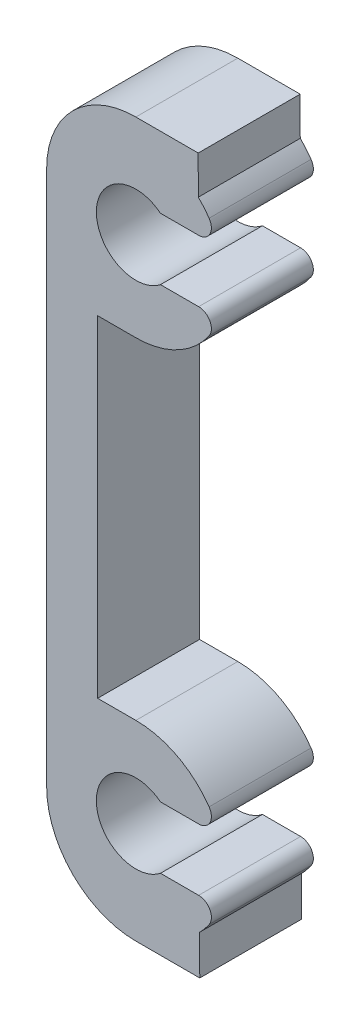
ISO-10303-21;
HEADER;
FILE_DESCRIPTION(('STEP AP214'),'2;1');
FILE_NAME('part.step','',(''),(''),'','','');
FILE_SCHEMA(('AUTOMOTIVE_DESIGN { 1 0 10303 214 1 1 1 1 }'));
ENDSEC;
DATA;
#1=APPLICATION_CONTEXT('core data for automotive mechanical design processes');
#2=APPLICATION_PROTOCOL_DEFINITION('international standard','automotive_design',2000,#1);
#3=PRODUCT_CONTEXT('',#1,'mechanical');
#4=PRODUCT('Part','Part','',(#3));
#5=PRODUCT_RELATED_PRODUCT_CATEGORY('part','',(#4));
#6=PRODUCT_DEFINITION_FORMATION('','',#4);
#7=PRODUCT_DEFINITION_CONTEXT('part definition',#1,'design');
#8=PRODUCT_DEFINITION('design','',#6,#7);
#9=PRODUCT_DEFINITION_SHAPE('','',#8);
#10=(LENGTH_UNIT() NAMED_UNIT(*) SI_UNIT(.MILLI.,.METRE.));
#11=(NAMED_UNIT(*) PLANE_ANGLE_UNIT() SI_UNIT($,.RADIAN.));
#12=(NAMED_UNIT(*) SI_UNIT($,.STERADIAN.) SOLID_ANGLE_UNIT());
#13=UNCERTAINTY_MEASURE_WITH_UNIT(LENGTH_MEASURE(1.E-05),#10,'distance_accuracy_value','');
#14=(GEOMETRIC_REPRESENTATION_CONTEXT(3) GLOBAL_UNCERTAINTY_ASSIGNED_CONTEXT((#13)) GLOBAL_UNIT_ASSIGNED_CONTEXT((#10,
#11,#12)) REPRESENTATION_CONTEXT('',''));
#15=CARTESIAN_POINT('',(0.,0.,0.));
#16=DIRECTION('',(0.,0.,1.));
#17=DIRECTION('',(1.,0.,0.));
#18=AXIS2_PLACEMENT_3D('',#15,#16,#17);
#19=CARTESIAN_POINT('',(-10.,-10.,4.));
#20=DIRECTION('',(0.,0.,-1.));
#21=DIRECTION('',(-1.,0.,0.));
#22=AXIS2_PLACEMENT_3D('',#19,#20,#21);
#23=CYLINDRICAL_SURFACE('',#22,3.5);
#24=CARTESIAN_POINT('',(-10.,-10.,4.));
#25=DIRECTION('',(0.,0.,1.));
#26=DIRECTION('',(-1.,0.,0.));
#27=AXIS2_PLACEMENT_3D('',#24,#25,#26);
#28=CIRCLE('',#27,3.5);
#29=CARTESIAN_POINT('',(-7.1261630428014,-8.00223596402391,4.));
#30=VERTEX_POINT('',#29);
#31=CARTESIAN_POINT('',(-10.,-6.5,4.));
#32=VERTEX_POINT('',#31);
#33=EDGE_CURVE('E269',#30,#32,#28,.T.);
#34=ORIENTED_EDGE('',*,*,#33,.F.);
#35=DIRECTION('',(0.,0.,-1.));
#36=VECTOR('',#35,1.);
#37=CARTESIAN_POINT('',(-7.1261630428014,-8.00223596402391,4.));
#38=LINE('',#37,#36);
#39=CARTESIAN_POINT('',(-7.1261630428014,-8.00223596402391,0.));
#40=VERTEX_POINT('',#39);
#41=EDGE_CURVE('E62',#30,#40,#38,.T.);
#42=ORIENTED_EDGE('',*,*,#41,.T.);
#43=CARTESIAN_POINT('',(-10.,-10.,0.));
#44=DIRECTION('',(0.,0.,1.));
#45=DIRECTION('',(-1.,0.,0.));
#46=AXIS2_PLACEMENT_3D('',#43,#44,#45);
#47=CIRCLE('',#46,3.5);
#48=CARTESIAN_POINT('',(-10.,-6.5,0.));
#49=VERTEX_POINT('',#48);
#50=EDGE_CURVE('E296',#40,#49,#47,.T.);
#51=ORIENTED_EDGE('',*,*,#50,.T.);
#52=DIRECTION('',(0.,0.,-1.));
#53=VECTOR('',#52,1.);
#54=CARTESIAN_POINT('',(-10.,-6.5,4.));
#55=LINE('',#54,#53);
#56=EDGE_CURVE('E314',#32,#49,#55,.T.);
#57=ORIENTED_EDGE('',*,*,#56,.F.);
#58=EDGE_LOOP('',(#34,#42,#51,#57));
#59=FACE_BOUND('',#58,.T.);
#60=ADVANCED_FACE('F47',(#59),#23,.T.);
#61=CARTESIAN_POINT('',(-7.49656428889574,-12.4459782583596,0.));
#62=VERTEX_POINT('',#61);
#63=CARTESIAN_POINT('',(-7.1261630428014,-11.9977640359761,0.));
#64=VERTEX_POINT('',#63);
#65=EDGE_CURVE('E297',#62,#64,#47,.T.);
#66=ORIENTED_EDGE('',*,*,#65,.T.);
#67=DIRECTION('',(0.,0.,-1.));
#68=VECTOR('',#67,1.);
#69=CARTESIAN_POINT('',(-7.1261630428014,-11.9977640359761,4.));
#70=LINE('',#69,#68);
#71=CARTESIAN_POINT('',(-7.1261630428014,-11.9977640359761,4.));
#72=VERTEX_POINT('',#71);
#73=EDGE_CURVE('E341',#64,#72,#70,.F.);
#74=ORIENTED_EDGE('',*,*,#73,.T.);
#75=CARTESIAN_POINT('',(-7.49656428889574,-12.4459782583596,4.));
#76=VERTEX_POINT('',#75);
#77=EDGE_CURVE('E270',#76,#72,#28,.T.);
#78=ORIENTED_EDGE('',*,*,#77,.F.);
#79=DIRECTION('',(0.,0.,-1.));
#80=VECTOR('',#79,1.);
#81=CARTESIAN_POINT('',(-7.49656428889574,-12.4459782583596,4.));
#82=LINE('',#81,#80);
#83=EDGE_CURVE('E317',#76,#62,#82,.T.);
#84=ORIENTED_EDGE('',*,*,#83,.T.);
#85=EDGE_LOOP('',(#66,#74,#78,#84));
#86=FACE_BOUND('',#85,.T.);
#87=ADVANCED_FACE('F410',(#86),#23,.T.);
#88=CARTESIAN_POINT('',(-10.,10.,4.));
#89=DIRECTION('',(0.,0.,1.));
#90=DIRECTION('',(1.,0.,0.));
#91=AXIS2_PLACEMENT_3D('',#88,#89,#90);
#92=PLANE('',#91);
#93=ORIENTED_EDGE('',*,*,#77,.T.);
#94=CARTESIAN_POINT('',(-7.53671117954405,-11.7123691736938,4.));
#95=DIRECTION('',(0.,0.,1.));
#96=DIRECTION('',(1.,0.,0.));
#97=AXIS2_PLACEMENT_3D('',#94,#95,#96);
#98=CIRCLE('',#97,0.5);
#99=CARTESIAN_POINT('',(-7.53671117954405,-11.2123691736938,4.));
#100=VERTEX_POINT('',#99);
#101=EDGE_CURVE('E350',#72,#100,#98,.T.);
#102=ORIENTED_EDGE('',*,*,#101,.T.);
#103=DIRECTION('',(-1.,0.,0.));
#104=VECTOR('',#103,1.);
#105=CARTESIAN_POINT('',(-9.03425625206423,-11.2123691736938,4.));
#106=LINE('',#105,#104);
#107=CARTESIAN_POINT('',(-9.03425625206423,-11.2123691736938,4.));
#108=VERTEX_POINT('',#107);
#109=EDGE_CURVE('E397',#100,#108,#106,.T.);
#110=ORIENTED_EDGE('',*,*,#109,.T.);
#111=CARTESIAN_POINT('',(-10.,-10.,4.));
#112=DIRECTION('',(0.,0.,1.));
#113=DIRECTION('',(1.,0.,0.));
#114=AXIS2_PLACEMENT_3D('',#111,#112,#113);
#115=CIRCLE('',#114,1.55);
#116=CARTESIAN_POINT('',(-9.03425625206423,-8.78763082630621,4.));
#117=VERTEX_POINT('',#116);
#118=EDGE_CURVE('E236',#117,#108,#115,.T.);
#119=ORIENTED_EDGE('',*,*,#118,.F.);
#120=DIRECTION('',(1.,0.,0.));
#121=VECTOR('',#120,1.);
#122=CARTESIAN_POINT('',(-9.03425625206423,-8.78763082630621,4.));
#123=LINE('',#122,#121);
#124=CARTESIAN_POINT('',(-7.53671117954405,-8.78763082630621,4.));
#125=VERTEX_POINT('',#124);
#126=EDGE_CURVE('E217',#117,#125,#123,.T.);
#127=ORIENTED_EDGE('',*,*,#126,.T.);
#128=CARTESIAN_POINT('',(-7.53671117954405,-8.28763082630621,4.));
#129=DIRECTION('',(0.,0.,1.));
#130=DIRECTION('',(1.,0.,0.));
#131=AXIS2_PLACEMENT_3D('',#128,#129,#130);
#132=CIRCLE('',#131,0.5);
#133=EDGE_CURVE('E348',#125,#30,#132,.T.);
#134=ORIENTED_EDGE('',*,*,#133,.T.);
#135=ORIENTED_EDGE('',*,*,#33,.T.);
#136=DIRECTION('',(-1.,0.,0.));
#137=VECTOR('',#136,1.);
#138=CARTESIAN_POINT('',(-10.,-6.5,4.));
#139=LINE('',#138,#137);
#140=CARTESIAN_POINT('',(-11.5,-6.5,4.));
#141=VERTEX_POINT('',#140);
#142=EDGE_CURVE('E273',#32,#141,#139,.T.);
#143=ORIENTED_EDGE('',*,*,#142,.T.);
#144=DIRECTION('',(0.,1.,0.));
#145=VECTOR('',#144,1.);
#146=CARTESIAN_POINT('',(-11.5,-6.5,4.));
#147=LINE('',#146,#145);
#148=CARTESIAN_POINT('',(-11.5,6.5,4.));
#149=VERTEX_POINT('',#148);
#150=EDGE_CURVE('E275',#141,#149,#147,.T.);
#151=ORIENTED_EDGE('',*,*,#150,.T.);
#152=DIRECTION('',(1.,0.,0.));
#153=VECTOR('',#152,1.);
#154=CARTESIAN_POINT('',(-10.,6.5,4.));
#155=LINE('',#154,#153);
#156=CARTESIAN_POINT('',(-10.,6.5,4.));
#157=VERTEX_POINT('',#156);
#158=EDGE_CURVE('E277',#149,#157,#155,.T.);
#159=ORIENTED_EDGE('',*,*,#158,.T.);
#160=CARTESIAN_POINT('',(-10.,10.,4.));
#161=DIRECTION('',(0.,0.,1.));
#162=DIRECTION('',(1.,0.,0.));
#163=AXIS2_PLACEMENT_3D('',#160,#161,#162);
#164=CIRCLE('',#163,3.5);
#165=CARTESIAN_POINT('',(-7.1261630428014,8.00223596402391,4.));
#166=VERTEX_POINT('',#165);
#167=EDGE_CURVE('E251',#157,#166,#164,.T.);
#168=ORIENTED_EDGE('',*,*,#167,.T.);
#169=CARTESIAN_POINT('',(-7.53671117954405,8.28763082630621,4.));
#170=DIRECTION('',(0.,0.,1.));
#171=DIRECTION('',(1.,0.,0.));
#172=AXIS2_PLACEMENT_3D('',#169,#170,#171);
#173=CIRCLE('',#172,0.5);
#174=CARTESIAN_POINT('',(-7.53671117954405,8.78763082630621,4.));
#175=VERTEX_POINT('',#174);
#176=EDGE_CURVE('E346',#166,#175,#173,.T.);
#177=ORIENTED_EDGE('',*,*,#176,.T.);
#178=DIRECTION('',(1.,0.,0.));
#179=VECTOR('',#178,1.);
#180=CARTESIAN_POINT('',(-9.03425625206423,8.78763082630621,4.));
#181=LINE('',#180,#179);
#182=CARTESIAN_POINT('',(-9.03425625206423,8.78763082630621,4.));
#183=VERTEX_POINT('',#182);
#184=EDGE_CURVE('E222',#183,#175,#181,.T.);
#185=ORIENTED_EDGE('',*,*,#184,.F.);
#186=CARTESIAN_POINT('',(-10.,10.,4.));
#187=DIRECTION('',(0.,0.,1.));
#188=DIRECTION('',(1.,0.,0.));
#189=AXIS2_PLACEMENT_3D('',#186,#187,#188);
#190=CIRCLE('',#189,1.55);
#191=CARTESIAN_POINT('',(-9.03425625206423,11.2123691736938,4.));
#192=VERTEX_POINT('',#191);
#193=EDGE_CURVE('E237',#192,#183,#190,.T.);
#194=ORIENTED_EDGE('',*,*,#193,.F.);
#195=DIRECTION('',(-1.,0.,0.));
#196=VECTOR('',#195,1.);
#197=CARTESIAN_POINT('',(-9.03425625206423,11.2123691736938,4.));
#198=LINE('',#197,#196);
#199=CARTESIAN_POINT('',(-7.53671117954405,11.2123691736938,4.));
#200=VERTEX_POINT('',#199);
#201=EDGE_CURVE('E374',#200,#192,#198,.T.);
#202=ORIENTED_EDGE('',*,*,#201,.F.);
#203=CARTESIAN_POINT('',(-7.53671117954405,11.7123691736938,4.));
#204=DIRECTION('',(0.,0.,1.));
#205=DIRECTION('',(1.,0.,0.));
#206=AXIS2_PLACEMENT_3D('',#203,#204,#205);
#207=CIRCLE('',#206,0.5);
#208=CARTESIAN_POINT('',(-7.1261630428014,11.9977640359761,4.));
#209=VERTEX_POINT('',#208);
#210=EDGE_CURVE('E344',#200,#209,#207,.T.);
#211=ORIENTED_EDGE('',*,*,#210,.T.);
#212=CARTESIAN_POINT('',(-7.55051025721682,12.5,4.));
#213=VERTEX_POINT('',#212);
#214=EDGE_CURVE('E255',#209,#213,#164,.T.);
#215=ORIENTED_EDGE('',*,*,#214,.T.);
#216=DIRECTION('',(-0.00216250658221706,0.999997661779907,0.));
#217=VECTOR('',#216,1.);
#218=CARTESIAN_POINT('',(-7.55051025721682,12.5,4.));
#219=LINE('',#218,#217);
#220=CARTESIAN_POINT('',(-7.55375402467479,14.,4.));
#221=VERTEX_POINT('',#220);
#222=EDGE_CURVE('E254',#213,#221,#219,.T.);
#223=ORIENTED_EDGE('',*,*,#222,.T.);
#224=DIRECTION('',(-1.,0.,0.));
#225=VECTOR('',#224,1.);
#226=CARTESIAN_POINT('',(-10.,14.,4.));
#227=LINE('',#226,#225);
#228=CARTESIAN_POINT('',(-10.,14.,4.));
#229=VERTEX_POINT('',#228);
#230=EDGE_CURVE('E257',#221,#229,#227,.T.);
#231=ORIENTED_EDGE('',*,*,#230,.T.);
#232=CARTESIAN_POINT('',(-10.,10.5,4.));
#233=DIRECTION('',(0.,0.,1.));
#234=DIRECTION('',(-1.,0.,0.));
#235=AXIS2_PLACEMENT_3D('',#232,#233,#234);
#236=CIRCLE('',#235,3.5);
#237=CARTESIAN_POINT('',(-13.5,10.5,4.));
#238=VERTEX_POINT('',#237);
#239=EDGE_CURVE('E259',#229,#238,#236,.T.);
#240=ORIENTED_EDGE('',*,*,#239,.T.);
#241=DIRECTION('',(0.,-1.,0.));
#242=VECTOR('',#241,1.);
#243=CARTESIAN_POINT('',(-13.5,-10.5,4.));
#244=LINE('',#243,#242);
#245=CARTESIAN_POINT('',(-13.5,-10.5,4.));
#246=VERTEX_POINT('',#245);
#247=EDGE_CURVE('E261',#238,#246,#244,.T.);
#248=ORIENTED_EDGE('',*,*,#247,.T.);
#249=CARTESIAN_POINT('',(-10.,-10.5,4.));
#250=DIRECTION('',(0.,0.,1.));
#251=DIRECTION('',(1.,0.,0.));
#252=AXIS2_PLACEMENT_3D('',#249,#250,#251);
#253=CIRCLE('',#252,3.5);
#254=CARTESIAN_POINT('',(-9.99999999999997,-14.,4.));
#255=VERTEX_POINT('',#254);
#256=EDGE_CURVE('E263',#246,#255,#253,.T.);
#257=ORIENTED_EDGE('',*,*,#256,.T.);
#258=DIRECTION('',(1.,0.,0.));
#259=VECTOR('',#258,1.);
#260=CARTESIAN_POINT('',(-9.99999999999997,-14.,4.));
#261=LINE('',#260,#259);
#262=CARTESIAN_POINT('',(-7.49320369879274,-14.,4.));
#263=VERTEX_POINT('',#262);
#264=EDGE_CURVE('E265',#255,#263,#261,.T.);
#265=ORIENTED_EDGE('',*,*,#264,.T.);
#266=DIRECTION('',(-0.00216250658221679,0.999997661779907,0.));
#267=VECTOR('',#266,1.);
#268=CARTESIAN_POINT('',(-7.49656428889574,-12.4459782583596,4.));
#269=LINE('',#268,#267);
#270=EDGE_CURVE('E267',#263,#76,#269,.T.);
#271=ORIENTED_EDGE('',*,*,#270,.T.);
#272=EDGE_LOOP('',(#93,#102,#110,#119,#127,#134,#135,#143,#151,#159,#168,#177,#185,#194,#202,
#211,#215,#223,#231,#240,#248,#257,#265,#271));
#273=FACE_BOUND('',#272,.T.);
#274=ADVANCED_FACE('F381',(#273),#92,.T.);
#275=CARTESIAN_POINT('',(-10.,10.,0.));
#276=DIRECTION('',(0.,0.,1.));
#277=DIRECTION('',(1.,0.,0.));
#278=AXIS2_PLACEMENT_3D('',#275,#276,#277);
#279=PLANE('',#278);
#280=DIRECTION('',(-1.,0.,0.));
#281=VECTOR('',#280,1.);
#282=CARTESIAN_POINT('',(-9.03425625206423,-11.2123691736938,0.));
#283=LINE('',#282,#281);
#284=CARTESIAN_POINT('',(-7.53671117954405,-11.2123691736938,0.));
#285=VERTEX_POINT('',#284);
#286=CARTESIAN_POINT('',(-9.03425625206423,-11.2123691736938,0.));
#287=VERTEX_POINT('',#286);
#288=EDGE_CURVE('E231',#285,#287,#283,.T.);
#289=ORIENTED_EDGE('',*,*,#288,.F.);
#290=CARTESIAN_POINT('',(-7.53671117954405,-11.7123691736938,0.));
#291=DIRECTION('',(0.,0.,1.));
#292=DIRECTION('',(1.,0.,0.));
#293=AXIS2_PLACEMENT_3D('',#290,#291,#292);
#294=CIRCLE('',#293,0.5);
#295=EDGE_CURVE('E358',#285,#64,#294,.F.);
#296=ORIENTED_EDGE('',*,*,#295,.T.);
#297=ORIENTED_EDGE('',*,*,#65,.F.);
#298=DIRECTION('',(-0.00216250658221679,0.999997661779907,0.));
#299=VECTOR('',#298,1.);
#300=CARTESIAN_POINT('',(-7.49656428889574,-12.4459782583596,0.));
#301=LINE('',#300,#299);
#302=CARTESIAN_POINT('',(-7.49320369879274,-14.,0.));
#303=VERTEX_POINT('',#302);
#304=EDGE_CURVE('E294',#303,#62,#301,.T.);
#305=ORIENTED_EDGE('',*,*,#304,.F.);
#306=DIRECTION('',(1.,0.,0.));
#307=VECTOR('',#306,1.);
#308=CARTESIAN_POINT('',(-9.99999999999997,-14.,0.));
#309=LINE('',#308,#307);
#310=CARTESIAN_POINT('',(-9.99999999999997,-14.,0.));
#311=VERTEX_POINT('',#310);
#312=EDGE_CURVE('E292',#311,#303,#309,.T.);
#313=ORIENTED_EDGE('',*,*,#312,.F.);
#314=CARTESIAN_POINT('',(-10.,-10.5,0.));
#315=DIRECTION('',(0.,0.,1.));
#316=DIRECTION('',(1.,0.,0.));
#317=AXIS2_PLACEMENT_3D('',#314,#315,#316);
#318=CIRCLE('',#317,3.5);
#319=CARTESIAN_POINT('',(-13.5,-10.5,0.));
#320=VERTEX_POINT('',#319);
#321=EDGE_CURVE('E290',#320,#311,#318,.T.);
#322=ORIENTED_EDGE('',*,*,#321,.F.);
#323=DIRECTION('',(0.,-1.,0.));
#324=VECTOR('',#323,1.);
#325=CARTESIAN_POINT('',(-13.5,-10.5,0.));
#326=LINE('',#325,#324);
#327=CARTESIAN_POINT('',(-13.5,10.5,0.));
#328=VERTEX_POINT('',#327);
#329=EDGE_CURVE('E288',#328,#320,#326,.T.);
#330=ORIENTED_EDGE('',*,*,#329,.F.);
#331=CARTESIAN_POINT('',(-10.,10.5,0.));
#332=DIRECTION('',(0.,0.,1.));
#333=DIRECTION('',(-1.,0.,0.));
#334=AXIS2_PLACEMENT_3D('',#331,#332,#333);
#335=CIRCLE('',#334,3.5);
#336=CARTESIAN_POINT('',(-10.,14.,0.));
#337=VERTEX_POINT('',#336);
#338=EDGE_CURVE('E286',#337,#328,#335,.T.);
#339=ORIENTED_EDGE('',*,*,#338,.F.);
#340=DIRECTION('',(-1.,0.,0.));
#341=VECTOR('',#340,1.);
#342=CARTESIAN_POINT('',(-10.,14.,0.));
#343=LINE('',#342,#341);
#344=CARTESIAN_POINT('',(-7.55375402467479,14.,0.));
#345=VERTEX_POINT('',#344);
#346=EDGE_CURVE('E284',#345,#337,#343,.T.);
#347=ORIENTED_EDGE('',*,*,#346,.F.);
#348=DIRECTION('',(-0.00216250658221706,0.999997661779907,0.));
#349=VECTOR('',#348,1.);
#350=CARTESIAN_POINT('',(-7.55051025721682,12.5,0.));
#351=LINE('',#350,#349);
#352=CARTESIAN_POINT('',(-7.55051025721682,12.5,0.));
#353=VERTEX_POINT('',#352);
#354=EDGE_CURVE('E282',#353,#345,#351,.T.);
#355=ORIENTED_EDGE('',*,*,#354,.F.);
#356=CARTESIAN_POINT('',(-10.,10.,0.));
#357=DIRECTION('',(0.,0.,1.));
#358=DIRECTION('',(1.,0.,0.));
#359=AXIS2_PLACEMENT_3D('',#356,#357,#358);
#360=CIRCLE('',#359,3.5);
#361=CARTESIAN_POINT('',(-7.1261630428014,11.9977640359761,0.));
#362=VERTEX_POINT('',#361);
#363=EDGE_CURVE('E239',#362,#353,#360,.T.);
#364=ORIENTED_EDGE('',*,*,#363,.F.);
#365=CARTESIAN_POINT('',(-7.53671117954405,11.7123691736938,0.));
#366=DIRECTION('',(0.,0.,1.));
#367=DIRECTION('',(1.,0.,0.));
#368=AXIS2_PLACEMENT_3D('',#365,#366,#367);
#369=CIRCLE('',#368,0.5);
#370=CARTESIAN_POINT('',(-7.53671117954405,11.2123691736938,0.));
#371=VERTEX_POINT('',#370);
#372=EDGE_CURVE('E354',#362,#371,#369,.F.);
#373=ORIENTED_EDGE('',*,*,#372,.T.);
#374=DIRECTION('',(-1.,0.,0.));
#375=VECTOR('',#374,1.);
#376=CARTESIAN_POINT('',(-9.03425625206423,11.2123691736938,0.));
#377=LINE('',#376,#375);
#378=CARTESIAN_POINT('',(-9.03425625206423,11.2123691736938,0.));
#379=VERTEX_POINT('',#378);
#380=EDGE_CURVE('E376',#371,#379,#377,.T.);
#381=ORIENTED_EDGE('',*,*,#380,.T.);
#382=CARTESIAN_POINT('',(-10.,10.,0.));
#383=DIRECTION('',(0.,0.,1.));
#384=DIRECTION('',(1.,0.,0.));
#385=AXIS2_PLACEMENT_3D('',#382,#383,#384);
#386=CIRCLE('',#385,1.55);
#387=CARTESIAN_POINT('',(-9.03425625206423,8.78763082630621,0.));
#388=VERTEX_POINT('',#387);
#389=EDGE_CURVE('E242',#379,#388,#386,.T.);
#390=ORIENTED_EDGE('',*,*,#389,.T.);
#391=DIRECTION('',(1.,0.,0.));
#392=VECTOR('',#391,1.);
#393=CARTESIAN_POINT('',(-9.03425625206423,8.78763082630621,0.));
#394=LINE('',#393,#392);
#395=CARTESIAN_POINT('',(-7.53671117954405,8.78763082630621,0.));
#396=VERTEX_POINT('',#395);
#397=EDGE_CURVE('E384',#388,#396,#394,.T.);
#398=ORIENTED_EDGE('',*,*,#397,.T.);
#399=CARTESIAN_POINT('',(-7.53671117954405,8.28763082630621,0.));
#400=DIRECTION('',(0.,0.,1.));
#401=DIRECTION('',(1.,0.,0.));
#402=AXIS2_PLACEMENT_3D('',#399,#400,#401);
#403=CIRCLE('',#402,0.5);
#404=CARTESIAN_POINT('',(-7.1261630428014,8.00223596402391,0.));
#405=VERTEX_POINT('',#404);
#406=EDGE_CURVE('E70',#396,#405,#403,.F.);
#407=ORIENTED_EDGE('',*,*,#406,.T.);
#408=CARTESIAN_POINT('',(-10.,6.5,0.));
#409=VERTEX_POINT('',#408);
#410=EDGE_CURVE('E280',#409,#405,#360,.T.);
#411=ORIENTED_EDGE('',*,*,#410,.F.);
#412=DIRECTION('',(1.,0.,0.));
#413=VECTOR('',#412,1.);
#414=CARTESIAN_POINT('',(-10.,6.5,0.));
#415=LINE('',#414,#413);
#416=CARTESIAN_POINT('',(-11.5,6.5,0.));
#417=VERTEX_POINT('',#416);
#418=EDGE_CURVE('E304',#417,#409,#415,.T.);
#419=ORIENTED_EDGE('',*,*,#418,.F.);
#420=DIRECTION('',(0.,1.,0.));
#421=VECTOR('',#420,1.);
#422=CARTESIAN_POINT('',(-11.5,-6.5,0.));
#423=LINE('',#422,#421);
#424=CARTESIAN_POINT('',(-11.5,-6.5,0.));
#425=VERTEX_POINT('',#424);
#426=EDGE_CURVE('E302',#425,#417,#423,.T.);
#427=ORIENTED_EDGE('',*,*,#426,.F.);
#428=DIRECTION('',(-1.,0.,0.));
#429=VECTOR('',#428,1.);
#430=CARTESIAN_POINT('',(-10.,-6.5,0.));
#431=LINE('',#430,#429);
#432=EDGE_CURVE('E300',#49,#425,#431,.T.);
#433=ORIENTED_EDGE('',*,*,#432,.F.);
#434=ORIENTED_EDGE('',*,*,#50,.F.);
#435=CARTESIAN_POINT('',(-7.53671117954405,-8.28763082630621,0.));
#436=DIRECTION('',(0.,0.,1.));
#437=DIRECTION('',(1.,0.,0.));
#438=AXIS2_PLACEMENT_3D('',#435,#436,#437);
#439=CIRCLE('',#438,0.5);
#440=CARTESIAN_POINT('',(-7.53671117954405,-8.78763082630621,0.));
#441=VERTEX_POINT('',#440);
#442=EDGE_CURVE('E230',#40,#441,#439,.F.);
#443=ORIENTED_EDGE('',*,*,#442,.T.);
#444=DIRECTION('',(1.,0.,0.));
#445=VECTOR('',#444,1.);
#446=CARTESIAN_POINT('',(-9.03425625206423,-8.78763082630621,0.));
#447=LINE('',#446,#445);
#448=CARTESIAN_POINT('',(-9.03425625206423,-8.78763082630621,0.));
#449=VERTEX_POINT('',#448);
#450=EDGE_CURVE('E214',#449,#441,#447,.T.);
#451=ORIENTED_EDGE('',*,*,#450,.F.);
#452=CARTESIAN_POINT('',(-10.,-10.,0.));
#453=DIRECTION('',(0.,0.,1.));
#454=DIRECTION('',(1.,0.,0.));
#455=AXIS2_PLACEMENT_3D('',#452,#453,#454);
#456=CIRCLE('',#455,1.55);
#457=EDGE_CURVE('E228',#449,#287,#456,.T.);
#458=ORIENTED_EDGE('',*,*,#457,.T.);
#459=EDGE_LOOP('',(#289,#296,#297,#305,#313,#322,#330,#339,#347,#355,#364,#373,#381,#390,#398,
#407,#411,#419,#427,#433,#434,#443,#451,#458));
#460=FACE_BOUND('',#459,.T.);
#461=ADVANCED_FACE('F227',(#460),#279,.F.);
#462=CARTESIAN_POINT('',(-10.,-10.,4.001));
#463=DIRECTION('',(0.,0.,-1.));
#464=DIRECTION('',(-1.,0.,0.));
#465=AXIS2_PLACEMENT_3D('',#462,#463,#464);
#466=CYLINDRICAL_SURFACE('',#465,1.55);
#467=ORIENTED_EDGE('',*,*,#457,.F.);
#468=DIRECTION('',(0.,0.,1.));
#469=VECTOR('',#468,1.);
#470=CARTESIAN_POINT('',(-9.03425625206423,-8.78763082630621,0.));
#471=LINE('',#470,#469);
#472=EDGE_CURVE('E210',#449,#117,#471,.T.);
#473=ORIENTED_EDGE('',*,*,#472,.T.);
#474=ORIENTED_EDGE('',*,*,#118,.T.);
#475=DIRECTION('',(0.,0.,1.));
#476=VECTOR('',#475,1.);
#477=CARTESIAN_POINT('',(-9.03425625206423,-11.2123691736938,0.));
#478=LINE('',#477,#476);
#479=EDGE_CURVE('E223',#287,#108,#478,.T.);
#480=ORIENTED_EDGE('',*,*,#479,.F.);
#481=EDGE_LOOP('',(#467,#473,#474,#480));
#482=FACE_BOUND('',#481,.T.);
#483=ADVANCED_FACE('F234',(#482),#466,.F.);
#484=CARTESIAN_POINT('',(-10.,10.,4.));
#485=DIRECTION('',(0.,0.,-1.));
#486=DIRECTION('',(-1.,0.,0.));
#487=AXIS2_PLACEMENT_3D('',#484,#485,#486);
#488=CYLINDRICAL_SURFACE('',#487,3.5);
#489=ORIENTED_EDGE('',*,*,#214,.F.);
#490=DIRECTION('',(0.,0.,-1.));
#491=VECTOR('',#490,1.);
#492=CARTESIAN_POINT('',(-7.1261630428014,11.9977640359761,4.));
#493=LINE('',#492,#491);
#494=EDGE_CURVE('E13',#209,#362,#493,.T.);
#495=ORIENTED_EDGE('',*,*,#494,.T.);
#496=ORIENTED_EDGE('',*,*,#363,.T.);
#497=DIRECTION('',(0.,0.,-1.));
#498=VECTOR('',#497,1.);
#499=CARTESIAN_POINT('',(-7.55051025721682,12.5,4.));
#500=LINE('',#499,#498);
#501=EDGE_CURVE('E338',#213,#353,#500,.T.);
#502=ORIENTED_EDGE('',*,*,#501,.F.);
#503=EDGE_LOOP('',(#489,#495,#496,#502));
#504=FACE_BOUND('',#503,.T.);
#505=ADVANCED_FACE('F450',(#504),#488,.T.);
#506=ORIENTED_EDGE('',*,*,#410,.T.);
#507=DIRECTION('',(0.,0.,-1.));
#508=VECTOR('',#507,1.);
#509=CARTESIAN_POINT('',(-7.1261630428014,8.00223596402391,4.));
#510=LINE('',#509,#508);
#511=EDGE_CURVE('E363',#405,#166,#510,.F.);
#512=ORIENTED_EDGE('',*,*,#511,.T.);
#513=ORIENTED_EDGE('',*,*,#167,.F.);
#514=DIRECTION('',(0.,0.,-1.));
#515=VECTOR('',#514,1.);
#516=CARTESIAN_POINT('',(-10.,6.5,4.));
#517=LINE('',#516,#515);
#518=EDGE_CURVE('E279',#157,#409,#517,.T.);
#519=ORIENTED_EDGE('',*,*,#518,.T.);
#520=EDGE_LOOP('',(#506,#512,#513,#519));
#521=FACE_BOUND('',#520,.T.);
#522=ADVANCED_FACE('F452',(#521),#488,.T.);
#523=CARTESIAN_POINT('',(-7.55051025721682,12.5,4.));
#524=DIRECTION('',(-0.999997661779907,-0.00216250658221706,0.));
#525=DIRECTION('',(0.00216250658221706,-0.999997661779907,0.));
#526=AXIS2_PLACEMENT_3D('',#523,#524,#525);
#527=PLANE('',#526);
#528=ORIENTED_EDGE('',*,*,#354,.T.);
#529=DIRECTION('',(0.,0.,-1.));
#530=VECTOR('',#529,1.);
#531=CARTESIAN_POINT('',(-7.55375402467479,14.,4.));
#532=LINE('',#531,#530);
#533=EDGE_CURVE('E335',#221,#345,#532,.T.);
#534=ORIENTED_EDGE('',*,*,#533,.F.);
#535=ORIENTED_EDGE('',*,*,#222,.F.);
#536=ORIENTED_EDGE('',*,*,#501,.T.);
#537=EDGE_LOOP('',(#528,#534,#535,#536));
#538=FACE_BOUND('',#537,.T.);
#539=ADVANCED_FACE('F445',(#538),#527,.F.);
#540=CARTESIAN_POINT('',(-10.,14.,4.));
#541=DIRECTION('',(0.,-1.,0.));
#542=DIRECTION('',(1.,0.,0.));
#543=AXIS2_PLACEMENT_3D('',#540,#541,#542);
#544=PLANE('',#543);
#545=ORIENTED_EDGE('',*,*,#346,.T.);
#546=DIRECTION('',(0.,0.,-1.));
#547=VECTOR('',#546,1.);
#548=CARTESIAN_POINT('',(-10.,14.,4.));
#549=LINE('',#548,#547);
#550=EDGE_CURVE('E332',#229,#337,#549,.T.);
#551=ORIENTED_EDGE('',*,*,#550,.F.);
#552=ORIENTED_EDGE('',*,*,#230,.F.);
#553=ORIENTED_EDGE('',*,*,#533,.T.);
#554=EDGE_LOOP('',(#545,#551,#552,#553));
#555=FACE_BOUND('',#554,.T.);
#556=ADVANCED_FACE('F441',(#555),#544,.F.);
#557=CARTESIAN_POINT('',(-10.,10.5,4.));
#558=DIRECTION('',(0.,0.,-1.));
#559=DIRECTION('',(-1.,0.,0.));
#560=AXIS2_PLACEMENT_3D('',#557,#558,#559);
#561=CYLINDRICAL_SURFACE('',#560,3.5);
#562=ORIENTED_EDGE('',*,*,#338,.T.);
#563=DIRECTION('',(0.,0.,-1.));
#564=VECTOR('',#563,1.);
#565=CARTESIAN_POINT('',(-13.5,10.5,4.));
#566=LINE('',#565,#564);
#567=EDGE_CURVE('E329',#238,#328,#566,.T.);
#568=ORIENTED_EDGE('',*,*,#567,.F.);
#569=ORIENTED_EDGE('',*,*,#239,.F.);
#570=ORIENTED_EDGE('',*,*,#550,.T.);
#571=EDGE_LOOP('',(#562,#568,#569,#570));
#572=FACE_BOUND('',#571,.T.);
#573=ADVANCED_FACE('F436',(#572),#561,.T.);
#574=CARTESIAN_POINT('',(-13.5,-10.5,4.));
#575=DIRECTION('',(1.,0.,0.));
#576=DIRECTION('',(0.,0.,-1.));
#577=AXIS2_PLACEMENT_3D('',#574,#575,#576);
#578=PLANE('',#577);
#579=ORIENTED_EDGE('',*,*,#329,.T.);
#580=DIRECTION('',(0.,0.,-1.));
#581=VECTOR('',#580,1.);
#582=CARTESIAN_POINT('',(-13.5,-10.5,4.));
#583=LINE('',#582,#581);
#584=EDGE_CURVE('E326',#246,#320,#583,.T.);
#585=ORIENTED_EDGE('',*,*,#584,.F.);
#586=ORIENTED_EDGE('',*,*,#247,.F.);
#587=ORIENTED_EDGE('',*,*,#567,.T.);
#588=EDGE_LOOP('',(#579,#585,#586,#587));
#589=FACE_BOUND('',#588,.T.);
#590=ADVANCED_FACE('F430',(#589),#578,.F.);
#591=CARTESIAN_POINT('',(-10.,-10.5,4.));
#592=DIRECTION('',(0.,0.,-1.));
#593=DIRECTION('',(-1.,0.,0.));
#594=AXIS2_PLACEMENT_3D('',#591,#592,#593);
#595=CYLINDRICAL_SURFACE('',#594,3.5);
#596=ORIENTED_EDGE('',*,*,#321,.T.);
#597=DIRECTION('',(0.,0.,-1.));
#598=VECTOR('',#597,1.);
#599=CARTESIAN_POINT('',(-9.99999999999997,-14.,4.));
#600=LINE('',#599,#598);
#601=EDGE_CURVE('E323',#255,#311,#600,.T.);
#602=ORIENTED_EDGE('',*,*,#601,.F.);
#603=ORIENTED_EDGE('',*,*,#256,.F.);
#604=ORIENTED_EDGE('',*,*,#584,.T.);
#605=EDGE_LOOP('',(#596,#602,#603,#604));
#606=FACE_BOUND('',#605,.T.);
#607=ADVANCED_FACE('F426',(#606),#595,.T.);
#608=CARTESIAN_POINT('',(-9.99999999999997,-14.,4.));
#609=DIRECTION('',(0.,1.,0.));
#610=DIRECTION('',(-1.,0.,0.));
#611=AXIS2_PLACEMENT_3D('',#608,#609,#610);
#612=PLANE('',#611);
#613=ORIENTED_EDGE('',*,*,#312,.T.);
#614=DIRECTION('',(0.,0.,-1.));
#615=VECTOR('',#614,1.);
#616=CARTESIAN_POINT('',(-7.49320369879274,-14.,4.));
#617=LINE('',#616,#615);
#618=EDGE_CURVE('E320',#263,#303,#617,.T.);
#619=ORIENTED_EDGE('',*,*,#618,.F.);
#620=ORIENTED_EDGE('',*,*,#264,.F.);
#621=ORIENTED_EDGE('',*,*,#601,.T.);
#622=EDGE_LOOP('',(#613,#619,#620,#621));
#623=FACE_BOUND('',#622,.T.);
#624=ADVANCED_FACE('F422',(#623),#612,.F.);
#625=CARTESIAN_POINT('',(-7.49656428889574,-12.4459782583596,4.));
#626=DIRECTION('',(-0.999997661779907,-0.00216250658221679,0.));
#627=DIRECTION('',(0.00216250658221679,-0.999997661779907,0.));
#628=AXIS2_PLACEMENT_3D('',#625,#626,#627);
#629=PLANE('',#628);
#630=ORIENTED_EDGE('',*,*,#304,.T.);
#631=ORIENTED_EDGE('',*,*,#83,.F.);
#632=ORIENTED_EDGE('',*,*,#270,.F.);
#633=ORIENTED_EDGE('',*,*,#618,.T.);
#634=EDGE_LOOP('',(#630,#631,#632,#633));
#635=FACE_BOUND('',#634,.T.);
#636=ADVANCED_FACE('F416',(#635),#629,.F.);
#637=CARTESIAN_POINT('',(-10.,-6.5,4.));
#638=DIRECTION('',(0.,-1.,0.));
#639=DIRECTION('',(0.,0.,-1.));
#640=AXIS2_PLACEMENT_3D('',#637,#638,#639);
#641=PLANE('',#640);
#642=ORIENTED_EDGE('',*,*,#432,.T.);
#643=DIRECTION('',(0.,0.,-1.));
#644=VECTOR('',#643,1.);
#645=CARTESIAN_POINT('',(-11.5,-6.5,4.));
#646=LINE('',#645,#644);
#647=EDGE_CURVE('E311',#141,#425,#646,.T.);
#648=ORIENTED_EDGE('',*,*,#647,.F.);
#649=ORIENTED_EDGE('',*,*,#142,.F.);
#650=ORIENTED_EDGE('',*,*,#56,.T.);
#651=EDGE_LOOP('',(#642,#648,#649,#650));
#652=FACE_BOUND('',#651,.T.);
#653=ADVANCED_FACE('F470',(#652),#641,.F.);
#654=CARTESIAN_POINT('',(-11.5,-6.5,4.));
#655=DIRECTION('',(-1.,0.,0.));
#656=DIRECTION('',(0.,0.,1.));
#657=AXIS2_PLACEMENT_3D('',#654,#655,#656);
#658=PLANE('',#657);
#659=ORIENTED_EDGE('',*,*,#426,.T.);
#660=DIRECTION('',(0.,0.,-1.));
#661=VECTOR('',#660,1.);
#662=CARTESIAN_POINT('',(-11.5,6.5,4.));
#663=LINE('',#662,#661);
#664=EDGE_CURVE('E308',#149,#417,#663,.T.);
#665=ORIENTED_EDGE('',*,*,#664,.F.);
#666=ORIENTED_EDGE('',*,*,#150,.F.);
#667=ORIENTED_EDGE('',*,*,#647,.T.);
#668=EDGE_LOOP('',(#659,#665,#666,#667));
#669=FACE_BOUND('',#668,.T.);
#670=ADVANCED_FACE('F519',(#669),#658,.F.);
#671=CARTESIAN_POINT('',(-10.,6.5,4.));
#672=DIRECTION('',(0.,1.,0.));
#673=DIRECTION('',(0.,0.,1.));
#674=AXIS2_PLACEMENT_3D('',#671,#672,#673);
#675=PLANE('',#674);
#676=ORIENTED_EDGE('',*,*,#418,.T.);
#677=ORIENTED_EDGE('',*,*,#518,.F.);
#678=ORIENTED_EDGE('',*,*,#158,.F.);
#679=ORIENTED_EDGE('',*,*,#664,.T.);
#680=EDGE_LOOP('',(#676,#677,#678,#679));
#681=FACE_BOUND('',#680,.T.);
#682=ADVANCED_FACE('F526',(#681),#675,.F.);
#683=CARTESIAN_POINT('',(-10.,10.,4.001));
#684=DIRECTION('',(0.,0.,-1.));
#685=DIRECTION('',(-1.,0.,0.));
#686=AXIS2_PLACEMENT_3D('',#683,#684,#685);
#687=CYLINDRICAL_SURFACE('',#686,1.55);
#688=DIRECTION('',(0.,0.,1.));
#689=VECTOR('',#688,1.);
#690=CARTESIAN_POINT('',(-9.03425625206423,11.2123691736938,0.));
#691=LINE('',#690,#689);
#692=EDGE_CURVE('E249',#379,#192,#691,.T.);
#693=ORIENTED_EDGE('',*,*,#692,.T.);
#694=ORIENTED_EDGE('',*,*,#193,.T.);
#695=DIRECTION('',(0.,0.,1.));
#696=VECTOR('',#695,1.);
#697=CARTESIAN_POINT('',(-9.03425625206423,8.78763082630621,0.));
#698=LINE('',#697,#696);
#699=EDGE_CURVE('E245',#388,#183,#698,.T.);
#700=ORIENTED_EDGE('',*,*,#699,.F.);
#701=ORIENTED_EDGE('',*,*,#389,.F.);
#702=EDGE_LOOP('',(#693,#694,#700,#701));
#703=FACE_BOUND('',#702,.T.);
#704=ADVANCED_FACE('F533',(#703),#687,.F.);
#705=CARTESIAN_POINT('',(-9.03425625206423,8.78763082630621,0.));
#706=DIRECTION('',(0.,-1.,0.));
#707=DIRECTION('',(0.,0.,-1.));
#708=AXIS2_PLACEMENT_3D('',#705,#706,#707);
#709=PLANE('',#708);
#710=ORIENTED_EDGE('',*,*,#184,.T.);
#711=DIRECTION('',(0.,0.,-1.));
#712=VECTOR('',#711,1.);
#713=CARTESIAN_POINT('',(-7.53671117954405,8.78763082630621,0.));
#714=LINE('',#713,#712);
#715=EDGE_CURVE('E366',#175,#396,#714,.T.);
#716=ORIENTED_EDGE('',*,*,#715,.T.);
#717=ORIENTED_EDGE('',*,*,#397,.F.);
#718=ORIENTED_EDGE('',*,*,#699,.T.);
#719=EDGE_LOOP('',(#710,#716,#717,#718));
#720=FACE_BOUND('',#719,.T.);
#721=ADVANCED_FACE('F542',(#720),#709,.F.);
#722=CARTESIAN_POINT('',(-9.03425625206423,11.2123691736938,0.));
#723=DIRECTION('',(0.,1.,0.));
#724=DIRECTION('',(-1.,0.,0.));
#725=AXIS2_PLACEMENT_3D('',#722,#723,#724);
#726=PLANE('',#725);
#727=ORIENTED_EDGE('',*,*,#380,.F.);
#728=DIRECTION('',(0.,0.,-1.));
#729=VECTOR('',#728,1.);
#730=CARTESIAN_POINT('',(-7.53671117954405,11.2123691736938,0.));
#731=LINE('',#730,#729);
#732=EDGE_CURVE('E55',#371,#200,#731,.F.);
#733=ORIENTED_EDGE('',*,*,#732,.T.);
#734=ORIENTED_EDGE('',*,*,#201,.T.);
#735=ORIENTED_EDGE('',*,*,#692,.F.);
#736=EDGE_LOOP('',(#727,#733,#734,#735));
#737=FACE_BOUND('',#736,.T.);
#738=ADVANCED_FACE('F372',(#737),#726,.F.);
#739=CARTESIAN_POINT('',(-9.03425625206423,-11.2123691736938,0.));
#740=DIRECTION('',(0.,1.,0.));
#741=DIRECTION('',(-1.,0.,0.));
#742=AXIS2_PLACEMENT_3D('',#739,#740,#741);
#743=PLANE('',#742);
#744=ORIENTED_EDGE('',*,*,#109,.F.);
#745=DIRECTION('',(0.,0.,1.));
#746=VECTOR('',#745,1.);
#747=CARTESIAN_POINT('',(-7.53671117954405,-11.2123691736938,0.));
#748=LINE('',#747,#746);
#749=EDGE_CURVE('E352',#100,#285,#748,.F.);
#750=ORIENTED_EDGE('',*,*,#749,.T.);
#751=ORIENTED_EDGE('',*,*,#288,.T.);
#752=ORIENTED_EDGE('',*,*,#479,.T.);
#753=EDGE_LOOP('',(#744,#750,#751,#752));
#754=FACE_BOUND('',#753,.T.);
#755=ADVANCED_FACE('F401',(#754),#743,.T.);
#756=CARTESIAN_POINT('',(-9.03425625206423,-8.78763082630621,0.));
#757=DIRECTION('',(0.,-1.,0.));
#758=DIRECTION('',(0.,0.,-1.));
#759=AXIS2_PLACEMENT_3D('',#756,#757,#758);
#760=PLANE('',#759);
#761=ORIENTED_EDGE('',*,*,#450,.T.);
#762=DIRECTION('',(0.,0.,1.));
#763=VECTOR('',#762,1.);
#764=CARTESIAN_POINT('',(-7.53671117954405,-8.78763082630621,4.));
#765=LINE('',#764,#763);
#766=EDGE_CURVE('E360',#441,#125,#765,.T.);
#767=ORIENTED_EDGE('',*,*,#766,.T.);
#768=ORIENTED_EDGE('',*,*,#126,.F.);
#769=ORIENTED_EDGE('',*,*,#472,.F.);
#770=EDGE_LOOP('',(#761,#767,#768,#769));
#771=FACE_BOUND('',#770,.T.);
#772=ADVANCED_FACE('F212',(#771),#760,.T.);
#773=CARTESIAN_POINT('',(-7.53671117954405,-11.7123691736938,4.));
#774=DIRECTION('',(0.,0.,-1.));
#775=DIRECTION('',(-1.,0.,0.));
#776=AXIS2_PLACEMENT_3D('',#773,#774,#775);
#777=CYLINDRICAL_SURFACE('',#776,0.5);
#778=ORIENTED_EDGE('',*,*,#295,.F.);
#779=ORIENTED_EDGE('',*,*,#749,.F.);
#780=ORIENTED_EDGE('',*,*,#101,.F.);
#781=ORIENTED_EDGE('',*,*,#73,.F.);
#782=EDGE_LOOP('',(#778,#779,#780,#781));
#783=FACE_BOUND('',#782,.T.);
#784=ADVANCED_FACE('F407',(#783),#777,.T.);
#785=CARTESIAN_POINT('',(-7.53671117954405,-8.28763082630621,4.));
#786=DIRECTION('',(0.,0.,-1.));
#787=DIRECTION('',(-1.,0.,0.));
#788=AXIS2_PLACEMENT_3D('',#785,#786,#787);
#789=CYLINDRICAL_SURFACE('',#788,0.5);
#790=ORIENTED_EDGE('',*,*,#442,.F.);
#791=ORIENTED_EDGE('',*,*,#41,.F.);
#792=ORIENTED_EDGE('',*,*,#133,.F.);
#793=ORIENTED_EDGE('',*,*,#766,.F.);
#794=EDGE_LOOP('',(#790,#791,#792,#793));
#795=FACE_BOUND('',#794,.T.);
#796=ADVANCED_FACE('F605',(#795),#789,.T.);
#797=CARTESIAN_POINT('',(-7.53671117954405,8.28763082630621,4.));
#798=DIRECTION('',(0.,0.,-1.));
#799=DIRECTION('',(-1.,0.,0.));
#800=AXIS2_PLACEMENT_3D('',#797,#798,#799);
#801=CYLINDRICAL_SURFACE('',#800,0.5);
#802=ORIENTED_EDGE('',*,*,#406,.F.);
#803=ORIENTED_EDGE('',*,*,#715,.F.);
#804=ORIENTED_EDGE('',*,*,#176,.F.);
#805=ORIENTED_EDGE('',*,*,#511,.F.);
#806=EDGE_LOOP('',(#802,#803,#804,#805));
#807=FACE_BOUND('',#806,.T.);
#808=ADVANCED_FACE('F611',(#807),#801,.T.);
#809=CARTESIAN_POINT('',(-7.53671117954405,11.7123691736938,4.));
#810=DIRECTION('',(0.,0.,-1.));
#811=DIRECTION('',(-1.,0.,0.));
#812=AXIS2_PLACEMENT_3D('',#809,#810,#811);
#813=CYLINDRICAL_SURFACE('',#812,0.5);
#814=ORIENTED_EDGE('',*,*,#372,.F.);
#815=ORIENTED_EDGE('',*,*,#494,.F.);
#816=ORIENTED_EDGE('',*,*,#210,.F.);
#817=ORIENTED_EDGE('',*,*,#732,.F.);
#818=EDGE_LOOP('',(#814,#815,#816,#817));
#819=FACE_BOUND('',#818,.T.);
#820=ADVANCED_FACE('F49',(#819),#813,.T.);
#821=CLOSED_SHELL('',(#60,#87,#274,#461,#483,#505,#522,#539,#556,#573,#590,#607,#624,#636,#653,
#670,#682,#704,#721,#738,#755,#772,#784,#796,#808,#820));
#822=MANIFOLD_SOLID_BREP('B2',#821);
#823=ADVANCED_BREP_SHAPE_REPRESENTATION('',(#18,#822),#14);
#824=SHAPE_DEFINITION_REPRESENTATION(#9,#823);
ENDSEC;
END-ISO-10303-21;
